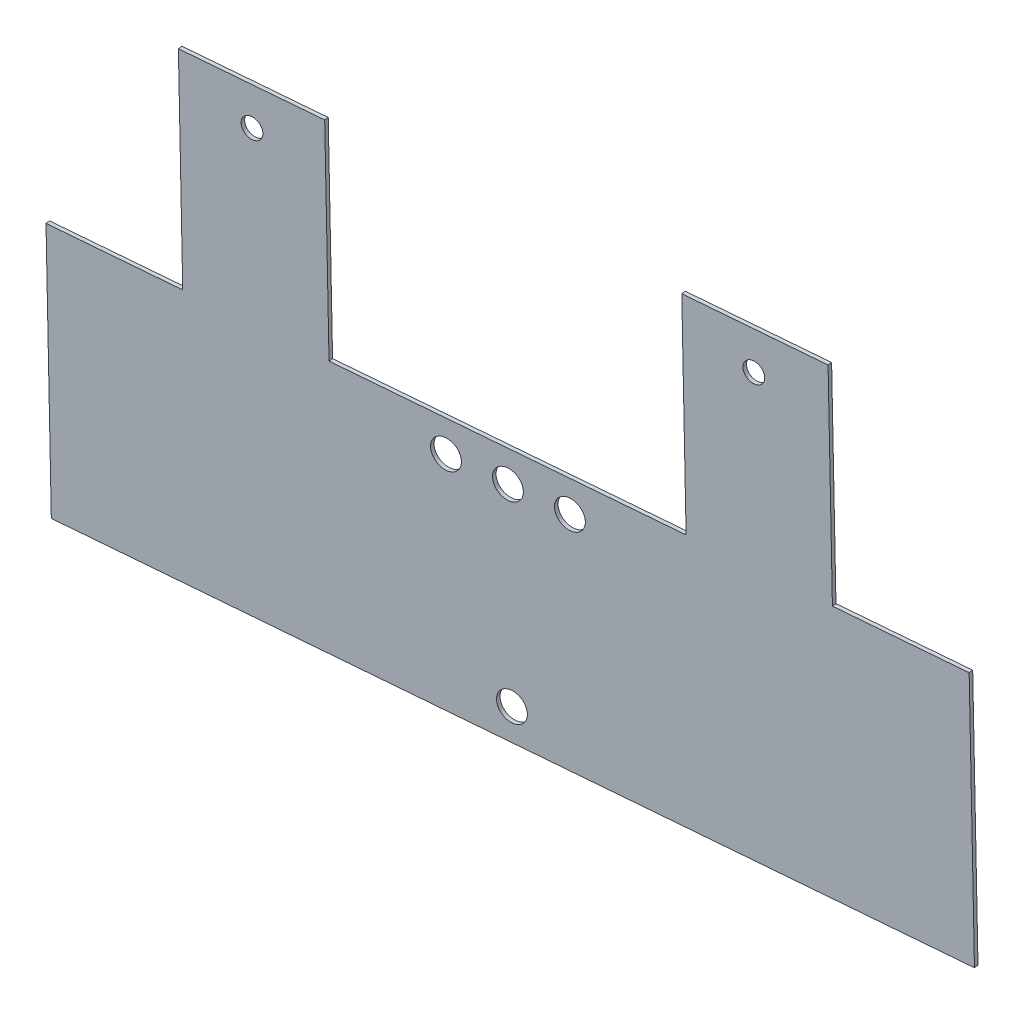
ISO-10303-21;
HEADER;
FILE_DESCRIPTION(('STEP AP214'),'2;1');
FILE_NAME('part.step','',(''),(''),'','','');
FILE_SCHEMA(('AUTOMOTIVE_DESIGN { 1 0 10303 214 1 1 1 1 }'));
ENDSEC;
DATA;
#1=APPLICATION_CONTEXT('core data for automotive mechanical design processes');
#2=APPLICATION_PROTOCOL_DEFINITION('international standard','automotive_design',2000,#1);
#3=PRODUCT_CONTEXT('',#1,'mechanical');
#4=PRODUCT('Part','Part','',(#3));
#5=PRODUCT_RELATED_PRODUCT_CATEGORY('part','',(#4));
#6=PRODUCT_DEFINITION_FORMATION('','',#4);
#7=PRODUCT_DEFINITION_CONTEXT('part definition',#1,'design');
#8=PRODUCT_DEFINITION('design','',#6,#7);
#9=PRODUCT_DEFINITION_SHAPE('','',#8);
#10=(LENGTH_UNIT() NAMED_UNIT(*) SI_UNIT(.MILLI.,.METRE.));
#11=(NAMED_UNIT(*) PLANE_ANGLE_UNIT() SI_UNIT($,.RADIAN.));
#12=(NAMED_UNIT(*) SI_UNIT($,.STERADIAN.) SOLID_ANGLE_UNIT());
#13=UNCERTAINTY_MEASURE_WITH_UNIT(LENGTH_MEASURE(1.E-05),#10,'distance_accuracy_value','');
#14=(GEOMETRIC_REPRESENTATION_CONTEXT(3) GLOBAL_UNCERTAINTY_ASSIGNED_CONTEXT((#13)) GLOBAL_UNIT_ASSIGNED_CONTEXT((#10,
#11,#12)) REPRESENTATION_CONTEXT('',''));
#15=CARTESIAN_POINT('',(0.,0.,0.));
#16=DIRECTION('',(0.,0.,1.));
#17=DIRECTION('',(1.,0.,0.));
#18=AXIS2_PLACEMENT_3D('',#15,#16,#17);
#19=CARTESIAN_POINT('',(-501.489956429642,-328.947406139133,240.499575413323));
#20=DIRECTION('',(0.99656940991837,0.00195950965151666,-0.0827379691367708));
#21=DIRECTION('',(-0.0827381279808112,0.,-0.996571323176736));
#22=AXIS2_PLACEMENT_3D('',#19,#20,#21);
#23=PLANE('',#22);
#24=DIRECTION('',(-0.00028055772663787,0.999793911631424,0.0202991515117986));
#25=VECTOR('',#24,1.);
#26=CARTESIAN_POINT('',(-501.439505510465,-328.959723900019,241.106959260261));
#27=LINE('',#26,#25);
#28=CARTESIAN_POINT('',(-501.439505510465,-328.959723900019,241.106959260261));
#29=VERTEX_POINT('',#28);
#30=CARTESIAN_POINT('',(-501.450907376476,-288.328099331318,241.9319167777));
#31=VERTEX_POINT('',#30);
#32=EDGE_CURVE('E177',#29,#31,#27,.T.);
#33=ORIENTED_EDGE('',*,*,#32,.T.);
#34=DIRECTION('',(0.082760694186997,-0.0202063006674291,0.99636457831008));
#35=VECTOR('',#34,1.);
#36=CARTESIAN_POINT('',(-501.501358295652,-288.315781570432,241.324532930762));
#37=LINE('',#36,#35);
#38=CARTESIAN_POINT('',(-501.501358295652,-288.315781570432,241.324532930762));
#39=VERTEX_POINT('',#38);
#40=EDGE_CURVE('E12',#39,#31,#37,.T.);
#41=ORIENTED_EDGE('',*,*,#40,.F.);
#42=DIRECTION('',(-0.00028055772663787,0.999793911631424,0.0202991515117986));
#43=VECTOR('',#42,1.);
#44=CARTESIAN_POINT('',(-501.489956429642,-328.947406139133,240.499575413323));
#45=LINE('',#44,#43);
#46=CARTESIAN_POINT('',(-501.489956429642,-328.947406139133,240.499575413323));
#47=VERTEX_POINT('',#46);
#48=EDGE_CURVE('E202',#47,#39,#45,.T.);
#49=ORIENTED_EDGE('',*,*,#48,.F.);
#50=DIRECTION('',(0.082760694186997,-0.0202063006674291,0.99636457831008));
#51=VECTOR('',#50,1.);
#52=CARTESIAN_POINT('',(-501.489956429642,-328.947406139133,240.499575413323));
#53=LINE('',#52,#51);
#54=EDGE_CURVE('E173',#47,#29,#53,.T.);
#55=ORIENTED_EDGE('',*,*,#54,.T.);
#56=EDGE_LOOP('',(#33,#41,#49,#55));
#57=FACE_BOUND('',#56,.T.);
#58=ADVANCED_FACE('F56',(#57),#23,.F.);
#59=CARTESIAN_POINT('',(-501.501358295652,-288.315781570432,241.324532930762));
#60=DIRECTION('',(0.000280557726639362,-0.999793911631424,-0.0202991515117987));
#61=DIRECTION('',(0.,0.0202991523106987,-0.999793950979634));
#62=AXIS2_PLACEMENT_3D('',#59,#60,#61);
#63=PLANE('',#62);
#64=DIRECTION('',(0.99656940991837,0.00195950965151815,-0.0827379691367705));
#65=VECTOR('',#64,1.);
#66=CARTESIAN_POINT('',(-501.450907376476,-288.328099331318,241.9319167777));
#67=LINE('',#66,#65);
#68=CARTESIAN_POINT('',(-481.580309912113,-288.289028668377,240.282204411082));
#69=VERTEX_POINT('',#68);
#70=EDGE_CURVE('E181',#31,#69,#67,.T.);
#71=ORIENTED_EDGE('',*,*,#70,.T.);
#72=DIRECTION('',(0.082760694186997,-0.0202063006674291,0.99636457831008));
#73=VECTOR('',#72,1.);
#74=CARTESIAN_POINT('',(-481.63076083129,-288.27671090749,239.674820564144));
#75=LINE('',#74,#73);
#76=CARTESIAN_POINT('',(-481.63076083129,-288.27671090749,239.674820564144));
#77=VERTEX_POINT('',#76);
#78=EDGE_CURVE('E64',#77,#69,#75,.T.);
#79=ORIENTED_EDGE('',*,*,#78,.F.);
#80=DIRECTION('',(0.99656940991837,0.00195950965151815,-0.0827379691367705));
#81=VECTOR('',#80,1.);
#82=CARTESIAN_POINT('',(-501.501358295652,-288.315781570432,241.324532930762));
#83=LINE('',#82,#81);
#84=EDGE_CURVE('E125',#39,#77,#83,.T.);
#85=ORIENTED_EDGE('',*,*,#84,.F.);
#86=ORIENTED_EDGE('',*,*,#40,.T.);
#87=EDGE_LOOP('',(#71,#79,#85,#86));
#88=FACE_BOUND('',#87,.T.);
#89=ADVANCED_FACE('F340',(#88),#63,.F.);
#90=CARTESIAN_POINT('',(-481.63076083129,-288.27671090749,239.674820564144));
#91=DIRECTION('',(0.99656940991837,0.00195950965151761,-0.0827379691367708));
#92=DIRECTION('',(-0.0827381279808112,0.,-0.996571323176736));
#93=AXIS2_PLACEMENT_3D('',#90,#91,#92);
#94=PLANE('',#93);
#95=DIRECTION('',(-0.000280557726638828,0.999793911631424,0.0202991515117985));
#96=VECTOR('',#95,1.);
#97=CARTESIAN_POINT('',(-481.580309912113,-288.289028668377,240.282204411082));
#98=LINE('',#97,#96);
#99=CARTESIAN_POINT('',(-481.589628158372,-255.082579541952,240.956406098194));
#100=VERTEX_POINT('',#99);
#101=EDGE_CURVE('E184',#69,#100,#98,.T.);
#102=ORIENTED_EDGE('',*,*,#101,.T.);
#103=DIRECTION('',(0.082760694186997,-0.0202063006674291,0.99636457831008));
#104=VECTOR('',#103,1.);
#105=CARTESIAN_POINT('',(-481.640079077549,-255.070261781065,240.349022251256));
#106=LINE('',#105,#104);
#107=CARTESIAN_POINT('',(-481.640079077549,-255.070261781065,240.349022251256));
#108=VERTEX_POINT('',#107);
#109=EDGE_CURVE('E221',#108,#100,#106,.T.);
#110=ORIENTED_EDGE('',*,*,#109,.F.);
#111=DIRECTION('',(-0.000280557726638828,0.999793911631424,0.0202991515117985));
#112=VECTOR('',#111,1.);
#113=CARTESIAN_POINT('',(-481.63076083129,-288.27671090749,239.674820564144));
#114=LINE('',#113,#112);
#115=EDGE_CURVE('E229',#77,#108,#114,.T.);
#116=ORIENTED_EDGE('',*,*,#115,.F.);
#117=ORIENTED_EDGE('',*,*,#78,.T.);
#118=EDGE_LOOP('',(#102,#110,#116,#117));
#119=FACE_BOUND('',#118,.T.);
#120=ADVANCED_FACE('F227',(#119),#94,.F.);
#121=CARTESIAN_POINT('',(-481.640079077549,-255.070261781065,240.349022251256));
#122=DIRECTION('',(0.000280557726637702,-0.999793911631424,-0.0202991515117986));
#123=DIRECTION('',(0.,0.0202991523106985,-0.999793950979634));
#124=AXIS2_PLACEMENT_3D('',#121,#122,#123);
#125=PLANE('',#124);
#126=DIRECTION('',(0.99656940991837,0.00195950965151649,-0.0827379691367709));
#127=VECTOR('',#126,1.);
#128=CARTESIAN_POINT('',(-481.589628158372,-255.082579541952,240.956406098194));
#129=LINE('',#128,#127);
#130=CARTESIAN_POINT('',(-460.326823228354,-255.040771444027,239.191108788692));
#131=VERTEX_POINT('',#130);
#132=EDGE_CURVE('E186',#100,#131,#129,.T.);
#133=ORIENTED_EDGE('',*,*,#132,.T.);
#134=DIRECTION('',(0.082760694186997,-0.0202063006674291,0.99636457831008));
#135=VECTOR('',#134,1.);
#136=CARTESIAN_POINT('',(-460.37727414753,-255.028453683141,238.583724941754));
#137=LINE('',#136,#135);
#138=CARTESIAN_POINT('',(-460.37727414753,-255.028453683141,238.583724941754));
#139=VERTEX_POINT('',#138);
#140=EDGE_CURVE('E218',#139,#131,#137,.T.);
#141=ORIENTED_EDGE('',*,*,#140,.F.);
#142=DIRECTION('',(0.99656940991837,0.00195950965151649,-0.0827379691367709));
#143=VECTOR('',#142,1.);
#144=CARTESIAN_POINT('',(-481.640079077549,-255.070261781065,240.349022251256));
#145=LINE('',#144,#143);
#146=EDGE_CURVE('E245',#108,#139,#145,.T.);
#147=ORIENTED_EDGE('',*,*,#146,.F.);
#148=ORIENTED_EDGE('',*,*,#109,.T.);
#149=EDGE_LOOP('',(#133,#141,#147,#148));
#150=FACE_BOUND('',#149,.T.);
#151=ADVANCED_FACE('F236',(#150),#125,.F.);
#152=CARTESIAN_POINT('',(-460.367955901271,-288.234902809565,237.909523254642));
#153=DIRECTION('',(-0.99656940991837,-0.00195950965151761,0.0827379691367708));
#154=DIRECTION('',(0.0827381279808112,0.,0.996571323176736));
#155=AXIS2_PLACEMENT_3D('',#152,#153,#154);
#156=PLANE('',#155);
#157=DIRECTION('',(0.000280557726638828,-0.999793911631424,-0.0202991515117985));
#158=VECTOR('',#157,1.);
#159=CARTESIAN_POINT('',(-460.317504982095,-288.247220570452,238.51690710158));
#160=LINE('',#159,#158);
#161=CARTESIAN_POINT('',(-460.317504982095,-288.247220570452,238.51690710158));
#162=VERTEX_POINT('',#161);
#163=EDGE_CURVE('E188',#131,#162,#160,.T.);
#164=ORIENTED_EDGE('',*,*,#163,.T.);
#165=DIRECTION('',(0.082760694186997,-0.0202063006674291,0.99636457831008));
#166=VECTOR('',#165,1.);
#167=CARTESIAN_POINT('',(-460.367955901271,-288.234902809565,237.909523254642));
#168=LINE('',#167,#166);
#169=CARTESIAN_POINT('',(-460.367955901271,-288.234902809565,237.909523254642));
#170=VERTEX_POINT('',#169);
#171=EDGE_CURVE('E215',#170,#162,#168,.T.);
#172=ORIENTED_EDGE('',*,*,#171,.F.);
#173=DIRECTION('',(0.000280557726638828,-0.999793911631424,-0.0202991515117985));
#174=VECTOR('',#173,1.);
#175=CARTESIAN_POINT('',(-460.367955901271,-288.234902809565,237.909523254642));
#176=LINE('',#175,#174);
#177=EDGE_CURVE('E242',#139,#170,#176,.T.);
#178=ORIENTED_EDGE('',*,*,#177,.F.);
#179=ORIENTED_EDGE('',*,*,#140,.T.);
#180=EDGE_LOOP('',(#164,#172,#178,#179));
#181=FACE_BOUND('',#180,.T.);
#182=ADVANCED_FACE('F240',(#181),#156,.F.);
#183=CARTESIAN_POINT('',(-460.367955901271,-288.234902809565,237.909523254642));
#184=DIRECTION('',(0.000280557726638659,-0.999793911631424,-0.0202991515117987));
#185=DIRECTION('',(0.,0.0202991523106986,-0.999793950979634));
#186=AXIS2_PLACEMENT_3D('',#183,#184,#185);
#187=PLANE('',#186);
#188=DIRECTION('',(0.99656940991837,0.00195950965151746,-0.0827379691367711));
#189=VECTOR('',#188,1.);
#190=CARTESIAN_POINT('',(-460.317504982095,-288.247220570452,238.51690710158));
#191=LINE('',#190,#189);
#192=CARTESIAN_POINT('',(-408.426135807645,-288.145188902897,234.208741048628));
#193=VERTEX_POINT('',#192);
#194=EDGE_CURVE('E190',#162,#193,#191,.T.);
#195=ORIENTED_EDGE('',*,*,#194,.T.);
#196=DIRECTION('',(0.082760694186997,-0.0202063006674291,0.99636457831008));
#197=VECTOR('',#196,1.);
#198=CARTESIAN_POINT('',(-408.476586726822,-288.132871142011,233.60135720169));
#199=LINE('',#198,#197);
#200=CARTESIAN_POINT('',(-408.476586726822,-288.132871142011,233.60135720169));
#201=VERTEX_POINT('',#200);
#202=EDGE_CURVE('E212',#201,#193,#199,.T.);
#203=ORIENTED_EDGE('',*,*,#202,.F.);
#204=DIRECTION('',(0.99656940991837,0.00195950965151746,-0.0827379691367711));
#205=VECTOR('',#204,1.);
#206=CARTESIAN_POINT('',(-460.367955901271,-288.234902809565,237.909523254642));
#207=LINE('',#206,#205);
#208=EDGE_CURVE('E244',#170,#201,#207,.T.);
#209=ORIENTED_EDGE('',*,*,#208,.F.);
#210=ORIENTED_EDGE('',*,*,#171,.T.);
#211=EDGE_LOOP('',(#195,#203,#209,#210));
#212=FACE_BOUND('',#211,.T.);
#213=ADVANCED_FACE('F353',(#212),#187,.F.);
#214=CARTESIAN_POINT('',(-408.476586726822,-288.132871142011,233.60135720169));
#215=DIRECTION('',(0.99656940991837,0.00195950965151767,-0.0827379691367708));
#216=DIRECTION('',(-0.0827381279808112,0.,-0.996571323176736));
#217=AXIS2_PLACEMENT_3D('',#214,#215,#216);
#218=PLANE('',#217);
#219=DIRECTION('',(-0.000280557726638828,0.999793911631424,0.0202991515117993));
#220=VECTOR('',#219,1.);
#221=CARTESIAN_POINT('',(-408.426135807645,-288.145188902897,234.208741048628));
#222=LINE('',#221,#220);
#223=CARTESIAN_POINT('',(-408.435454053904,-254.938739776473,234.88294273574));
#224=VERTEX_POINT('',#223);
#225=EDGE_CURVE('E192',#193,#224,#222,.T.);
#226=ORIENTED_EDGE('',*,*,#225,.T.);
#227=DIRECTION('',(0.082760694186997,-0.0202063006674291,0.99636457831008));
#228=VECTOR('',#227,1.);
#229=CARTESIAN_POINT('',(-408.485904973081,-254.926422015586,234.275558888802));
#230=LINE('',#229,#228);
#231=CARTESIAN_POINT('',(-408.485904973081,-254.926422015586,234.275558888802));
#232=VERTEX_POINT('',#231);
#233=EDGE_CURVE('E209',#232,#224,#230,.T.);
#234=ORIENTED_EDGE('',*,*,#233,.F.);
#235=DIRECTION('',(-0.000280557726638828,0.999793911631424,0.0202991515117993));
#236=VECTOR('',#235,1.);
#237=CARTESIAN_POINT('',(-408.476586726822,-288.132871142011,233.60135720169));
#238=LINE('',#237,#236);
#239=EDGE_CURVE('E247',#201,#232,#238,.T.);
#240=ORIENTED_EDGE('',*,*,#239,.F.);
#241=ORIENTED_EDGE('',*,*,#202,.T.);
#242=EDGE_LOOP('',(#226,#234,#240,#241));
#243=FACE_BOUND('',#242,.T.);
#244=ADVANCED_FACE('F356',(#243),#218,.F.);
#245=CARTESIAN_POINT('',(-408.485904973081,-254.926422015586,234.275558888802));
#246=DIRECTION('',(0.000280557726637702,-0.999793911631424,-0.0202991515117986));
#247=DIRECTION('',(0.,0.0202991523106985,-0.999793950979634));
#248=AXIS2_PLACEMENT_3D('',#245,#246,#247);
#249=PLANE('',#248);
#250=DIRECTION('',(0.99656940991837,0.00195950965151649,-0.0827379691367709));
#251=VECTOR('',#250,1.);
#252=CARTESIAN_POINT('',(-408.435454053904,-254.938739776473,234.88294273574));
#253=LINE('',#252,#251);
#254=CARTESIAN_POINT('',(-387.172649123886,-254.896931678548,233.117645426238));
#255=VERTEX_POINT('',#254);
#256=EDGE_CURVE('E194',#224,#255,#253,.T.);
#257=ORIENTED_EDGE('',*,*,#256,.T.);
#258=DIRECTION('',(0.082760694186997,-0.0202063006674291,0.99636457831008));
#259=VECTOR('',#258,1.);
#260=CARTESIAN_POINT('',(-387.223100043062,-254.884613917661,232.5102615793));
#261=LINE('',#260,#259);
#262=CARTESIAN_POINT('',(-387.223100043062,-254.884613917661,232.5102615793));
#263=VERTEX_POINT('',#262);
#264=EDGE_CURVE('E206',#263,#255,#261,.T.);
#265=ORIENTED_EDGE('',*,*,#264,.F.);
#266=DIRECTION('',(0.99656940991837,0.00195950965151649,-0.0827379691367709));
#267=VECTOR('',#266,1.);
#268=CARTESIAN_POINT('',(-408.485904973081,-254.926422015586,234.275558888802));
#269=LINE('',#268,#267);
#270=EDGE_CURVE('E253',#232,#263,#269,.T.);
#271=ORIENTED_EDGE('',*,*,#270,.F.);
#272=ORIENTED_EDGE('',*,*,#233,.T.);
#273=EDGE_LOOP('',(#257,#265,#271,#272));
#274=FACE_BOUND('',#273,.T.);
#275=ADVANCED_FACE('F259',(#274),#249,.F.);
#276=CARTESIAN_POINT('',(-387.213781796803,-288.091063044086,231.836059892188));
#277=DIRECTION('',(-0.99656940991837,-0.00195950965151761,0.0827379691367708));
#278=DIRECTION('',(0.0827381279808112,0.,0.996571323176736));
#279=AXIS2_PLACEMENT_3D('',#276,#277,#278);
#280=PLANE('',#279);
#281=DIRECTION('',(0.000280557726638828,-0.999793911631424,-0.0202991515117985));
#282=VECTOR('',#281,1.);
#283=CARTESIAN_POINT('',(-387.163330877627,-288.103380804973,232.443443739126));
#284=LINE('',#283,#282);
#285=CARTESIAN_POINT('',(-387.163330877627,-288.103380804973,232.443443739126));
#286=VERTEX_POINT('',#285);
#287=EDGE_CURVE('E196',#255,#286,#284,.T.);
#288=ORIENTED_EDGE('',*,*,#287,.T.);
#289=DIRECTION('',(0.082760694186997,-0.0202063006674291,0.99636457831008));
#290=VECTOR('',#289,1.);
#291=CARTESIAN_POINT('',(-387.213781796803,-288.091063044086,231.836059892188));
#292=LINE('',#291,#290);
#293=CARTESIAN_POINT('',(-387.213781796803,-288.091063044086,231.836059892188));
#294=VERTEX_POINT('',#293);
#295=EDGE_CURVE('E168',#294,#286,#292,.T.);
#296=ORIENTED_EDGE('',*,*,#295,.F.);
#297=DIRECTION('',(0.000280557726638828,-0.999793911631424,-0.0202991515117985));
#298=VECTOR('',#297,1.);
#299=CARTESIAN_POINT('',(-387.213781796803,-288.091063044086,231.836059892188));
#300=LINE('',#299,#298);
#301=EDGE_CURVE('E157',#263,#294,#300,.T.);
#302=ORIENTED_EDGE('',*,*,#301,.F.);
#303=ORIENTED_EDGE('',*,*,#264,.T.);
#304=EDGE_LOOP('',(#288,#296,#302,#303));
#305=FACE_BOUND('',#304,.T.);
#306=ADVANCED_FACE('F263',(#305),#280,.F.);
#307=CARTESIAN_POINT('',(-387.213781796803,-288.091063044086,231.836059892188));
#308=DIRECTION('',(0.000280557726639362,-0.999793911631424,-0.0202991515117987));
#309=DIRECTION('',(0.,0.0202991523106987,-0.999793950979634));
#310=AXIS2_PLACEMENT_3D('',#307,#308,#309);
#311=PLANE('',#310);
#312=DIRECTION('',(0.99656940991837,0.00195950965151815,-0.0827379691367705));
#313=VECTOR('',#312,1.);
#314=CARTESIAN_POINT('',(-387.163330877627,-288.103380804973,232.443443739126));
#315=LINE('',#314,#313);
#316=CARTESIAN_POINT('',(-367.292733413265,-288.064310142031,230.793731372508));
#317=VERTEX_POINT('',#316);
#318=EDGE_CURVE('E166',#286,#317,#315,.T.);
#319=ORIENTED_EDGE('',*,*,#318,.T.);
#320=DIRECTION('',(0.082760694186997,-0.0202063006674291,0.99636457831008));
#321=VECTOR('',#320,1.);
#322=CARTESIAN_POINT('',(-367.343184332441,-288.051992381144,230.18634752557));
#323=LINE('',#322,#321);
#324=CARTESIAN_POINT('',(-367.343184332441,-288.051992381144,230.18634752557));
#325=VERTEX_POINT('',#324);
#326=EDGE_CURVE('E163',#325,#317,#323,.T.);
#327=ORIENTED_EDGE('',*,*,#326,.F.);
#328=DIRECTION('',(0.99656940991837,0.00195950965151815,-0.0827379691367705));
#329=VECTOR('',#328,1.);
#330=CARTESIAN_POINT('',(-387.213781796803,-288.091063044086,231.836059892188));
#331=LINE('',#330,#329);
#332=EDGE_CURVE('E150',#294,#325,#331,.T.);
#333=ORIENTED_EDGE('',*,*,#332,.F.);
#334=ORIENTED_EDGE('',*,*,#295,.T.);
#335=EDGE_LOOP('',(#319,#327,#333,#334));
#336=FACE_BOUND('',#335,.T.);
#337=ADVANCED_FACE('F164',(#336),#311,.F.);
#338=CARTESIAN_POINT('',(-367.331782466431,-328.683616949845,229.361390008131));
#339=DIRECTION('',(-0.99656940991837,-0.00195950965151394,0.0827379691367708));
#340=DIRECTION('',(0.0827381279808113,0.,0.996571323176736));
#341=AXIS2_PLACEMENT_3D('',#338,#339,#340);
#342=PLANE('',#341);
#343=DIRECTION('',(0.000280557726635138,-0.999793911631424,-0.0202991515117986));
#344=VECTOR('',#343,1.);
#345=CARTESIAN_POINT('',(-367.281331547254,-328.695934710732,229.968773855068));
#346=LINE('',#345,#344);
#347=CARTESIAN_POINT('',(-367.281331547254,-328.695934710732,229.968773855068));
#348=VERTEX_POINT('',#347);
#349=EDGE_CURVE('E199',#317,#348,#346,.T.);
#350=ORIENTED_EDGE('',*,*,#349,.T.);
#351=DIRECTION('',(0.082760694186997,-0.0202063006674291,0.99636457831008));
#352=VECTOR('',#351,1.);
#353=CARTESIAN_POINT('',(-367.331782466431,-328.683616949845,229.361390008131));
#354=LINE('',#353,#352);
#355=CARTESIAN_POINT('',(-367.331782466431,-328.683616949845,229.361390008131));
#356=VERTEX_POINT('',#355);
#357=EDGE_CURVE('E169',#356,#348,#354,.T.);
#358=ORIENTED_EDGE('',*,*,#357,.F.);
#359=DIRECTION('',(0.000280557726635138,-0.999793911631424,-0.0202991515117986));
#360=VECTOR('',#359,1.);
#361=CARTESIAN_POINT('',(-367.331782466431,-328.683616949845,229.361390008131));
#362=LINE('',#361,#360);
#363=EDGE_CURVE('E154',#325,#356,#362,.T.);
#364=ORIENTED_EDGE('',*,*,#363,.F.);
#365=ORIENTED_EDGE('',*,*,#326,.T.);
#366=EDGE_LOOP('',(#350,#358,#364,#365));
#367=FACE_BOUND('',#366,.T.);
#368=ADVANCED_FACE('F171',(#367),#342,.F.);
#369=CARTESIAN_POINT('',(-501.489956429642,-328.947406139133,240.499575413323));
#370=DIRECTION('',(-0.000280557726639362,0.999793911631424,0.0202991515117987));
#371=DIRECTION('',(0.,-0.0202991523106987,0.999793950979634));
#372=AXIS2_PLACEMENT_3D('',#369,#370,#371);
#373=PLANE('',#372);
#374=DIRECTION('',(-0.99656940991837,-0.00195950965151815,0.0827379691367705));
#375=VECTOR('',#374,1.);
#376=CARTESIAN_POINT('',(-501.439505510465,-328.959723900019,241.106959260261));
#377=LINE('',#376,#375);
#378=EDGE_CURVE('E113',#348,#29,#377,.T.);
#379=ORIENTED_EDGE('',*,*,#378,.T.);
#380=ORIENTED_EDGE('',*,*,#54,.F.);
#381=DIRECTION('',(-0.99656940991837,-0.00195950965151794,0.0827379691367709));
#382=VECTOR('',#381,1.);
#383=CARTESIAN_POINT('',(-386.587283527019,-328.721478176367,230.960035357474));
#384=LINE('',#383,#382);
#385=EDGE_CURVE('E72',#356,#47,#384,.T.);
#386=ORIENTED_EDGE('',*,*,#385,.F.);
#387=ORIENTED_EDGE('',*,*,#357,.T.);
#388=EDGE_LOOP('',(#379,#380,#386,#387));
#389=FACE_BOUND('',#388,.T.);
#390=ADVANCED_FACE('F264',(#389),#373,.F.);
#391=CARTESIAN_POINT('',(16.9467758676456,-4.13761208613666,204.023991786853));
#392=DIRECTION('',(-0.0827606941869968,0.0202063006674291,-0.99636457831008));
#393=DIRECTION('',(-0.996568045750024,0.,0.0827775947341869));
#394=AXIS2_PLACEMENT_3D('',#391,#392,#393);
#395=PLANE('',#394);
#396=CARTESIAN_POINT('',(-425.456033015418,-293.165229384197,234.909658847919));
#397=DIRECTION('',(-0.0827606941869968,0.0202063006674291,-0.99636457831008));
#398=DIRECTION('',(-0.996568045750024,0.,0.0827775947341869));
#399=AXIS2_PLACEMENT_3D('',#396,#397,#398);
#400=CIRCLE('',#399,2.24999999999995);
#401=CARTESIAN_POINT('',(-427.698311118356,-293.165229384197,235.095908436071));
#402=VERTEX_POINT('',#401);
#403=EDGE_CURVE('E294',#402,#402,#400,.T.);
#404=ORIENTED_EDGE('',*,*,#403,.F.);
#405=EDGE_LOOP('',(#404));
#406=FACE_BOUND('',#405,.T.);
#407=CARTESIAN_POINT('',(-443.473097110311,-293.200655527759,236.405485709734));
#408=DIRECTION('',(-0.0827606941869968,0.0202063006674291,-0.99636457831008));
#409=DIRECTION('',(-0.996568045750024,0.,0.0827775947341869));
#410=AXIS2_PLACEMENT_3D('',#407,#408,#409);
#411=CIRCLE('',#410,2.24999999999995);
#412=CARTESIAN_POINT('',(-445.715375213249,-293.200655527759,236.591735297886));
#413=VERTEX_POINT('',#412);
#414=EDGE_CURVE('E297',#413,#413,#411,.T.);
#415=ORIENTED_EDGE('',*,*,#414,.F.);
#416=EDGE_LOOP('',(#415));
#417=FACE_BOUND('',#416,.T.);
#418=CARTESIAN_POINT('',(-471.054813760999,-261.10108861582,239.347476604441));
#419=DIRECTION('',(-0.0827606941869969,0.0202063006674291,-0.99636457831008));
#420=DIRECTION('',(-0.996568045750024,0.,0.0827775947341869));
#421=AXIS2_PLACEMENT_3D('',#418,#419,#420);
#422=CIRCLE('',#421,1.58750000000002);
#423=CARTESIAN_POINT('',(-472.636865533627,-261.10108861582,239.478886036081));
#424=VERTEX_POINT('',#423);
#425=EDGE_CURVE('E291',#424,#424,#422,.T.);
#426=ORIENTED_EDGE('',*,*,#425,.F.);
#427=EDGE_LOOP('',(#426));
#428=FACE_BOUND('',#427,.T.);
#429=CARTESIAN_POINT('',(-398.13117772993,-260.957702145591,233.293153155214));
#430=DIRECTION('',(-0.0827606941869968,0.0202063006674291,-0.99636457831008));
#431=DIRECTION('',(-0.996568045750024,0.,0.0827775947341869));
#432=AXIS2_PLACEMENT_3D('',#429,#430,#431);
#433=CIRCLE('',#432,1.58750000000003);
#434=CARTESIAN_POINT('',(-399.713229502559,-260.957702145591,233.424562586854));
#435=VERTEX_POINT('',#434);
#436=EDGE_CURVE('E285',#435,#435,#433,.T.);
#437=ORIENTED_EDGE('',*,*,#436,.F.);
#438=EDGE_LOOP('',(#437));
#439=FACE_BOUND('',#438,.T.);
#440=CARTESIAN_POINT('',(-434.464565062866,-293.182942453393,235.657572278879));
#441=DIRECTION('',(0.0827606941869969,-0.0202063006674292,0.99636457831008));
#442=DIRECTION('',(-0.996566946014347,-0.00391901177606996,0.0826980257221201));
#443=AXIS2_PLACEMENT_3D('',#440,#441,#442);
#444=CIRCLE('',#443,2.24999999999995);
#445=CARTESIAN_POINT('',(-436.706840691398,-293.191760229889,235.843642836754));
#446=VERTEX_POINT('',#445);
#447=EDGE_CURVE('E279',#446,#446,#444,.T.);
#448=ORIENTED_EDGE('',*,*,#447,.T.);
#449=EDGE_LOOP('',(#448));
#450=FACE_BOUND('',#449,.T.);
#451=CARTESIAN_POINT('',(-434.455968774122,-323.816627903961,235.035606276595));
#452=DIRECTION('',(-0.0827606941869969,0.0202063006674291,-0.99636457831008));
#453=DIRECTION('',(-0.996568045750024,0.,0.0827775947341869));
#454=AXIS2_PLACEMENT_3D('',#451,#452,#453);
#455=CIRCLE('',#454,2.24999999999995);
#456=CARTESIAN_POINT('',(-436.69824687706,-323.816627903961,235.221855864746));
#457=VERTEX_POINT('',#456);
#458=EDGE_CURVE('E273',#457,#457,#455,.T.);
#459=ORIENTED_EDGE('',*,*,#458,.F.);
#460=EDGE_LOOP('',(#459));
#461=FACE_BOUND('',#460,.T.);
#462=ORIENTED_EDGE('',*,*,#48,.T.);
#463=ORIENTED_EDGE('',*,*,#84,.T.);
#464=ORIENTED_EDGE('',*,*,#115,.T.);
#465=ORIENTED_EDGE('',*,*,#146,.T.);
#466=ORIENTED_EDGE('',*,*,#177,.T.);
#467=ORIENTED_EDGE('',*,*,#208,.T.);
#468=ORIENTED_EDGE('',*,*,#239,.T.);
#469=ORIENTED_EDGE('',*,*,#270,.T.);
#470=ORIENTED_EDGE('',*,*,#301,.T.);
#471=ORIENTED_EDGE('',*,*,#332,.T.);
#472=ORIENTED_EDGE('',*,*,#363,.T.);
#473=ORIENTED_EDGE('',*,*,#385,.T.);
#474=EDGE_LOOP('',(#462,#463,#464,#465,#466,#467,#468,#469,#470,#471,#472,#473));
#475=FACE_BOUND('',#474,.T.);
#476=ADVANCED_FACE('F152',(#406,#417,#428,#439,#450,#461,#475),#395,.T.);
#477=CARTESIAN_POINT('',(16.997226786822,-4.14992984702352,204.631375633791));
#478=DIRECTION('',(-0.0827606941869968,0.0202063006674291,-0.99636457831008));
#479=DIRECTION('',(-0.996568045750024,0.,0.0827775947341869));
#480=AXIS2_PLACEMENT_3D('',#477,#478,#479);
#481=PLANE('',#480);
#482=CARTESIAN_POINT('',(-425.405582096242,-293.177547145084,235.517042694857));
#483=DIRECTION('',(0.0827606941869968,-0.0202063006674291,0.99636457831008));
#484=DIRECTION('',(0.996568045750024,0.,-0.0827775947341869));
#485=AXIS2_PLACEMENT_3D('',#482,#483,#484);
#486=CIRCLE('',#485,2.24999999999995);
#487=CARTESIAN_POINT('',(-423.163303993304,-293.177547145084,235.330793106705));
#488=VERTEX_POINT('',#487);
#489=EDGE_CURVE('E300',#488,#488,#486,.T.);
#490=ORIENTED_EDGE('',*,*,#489,.F.);
#491=EDGE_LOOP('',(#490));
#492=FACE_BOUND('',#491,.T.);
#493=CARTESIAN_POINT('',(-443.422646191135,-293.212973288646,237.012869556672));
#494=DIRECTION('',(0.0827606941869968,-0.0202063006674291,0.99636457831008));
#495=DIRECTION('',(0.996568045750024,0.,-0.0827775947341869));
#496=AXIS2_PLACEMENT_3D('',#493,#494,#495);
#497=CIRCLE('',#496,2.24999999999995);
#498=CARTESIAN_POINT('',(-441.180368088198,-293.212973288646,236.82661996852));
#499=VERTEX_POINT('',#498);
#500=EDGE_CURVE('E301',#499,#499,#497,.T.);
#501=ORIENTED_EDGE('',*,*,#500,.F.);
#502=EDGE_LOOP('',(#501));
#503=FACE_BOUND('',#502,.T.);
#504=CARTESIAN_POINT('',(-471.004362841823,-261.113406376707,239.954860451379));
#505=DIRECTION('',(-0.0827606941869968,0.0202063006674291,-0.99636457831008));
#506=DIRECTION('',(-0.996568045750024,0.,0.0827775947341869));
#507=AXIS2_PLACEMENT_3D('',#504,#505,#506);
#508=CIRCLE('',#507,1.58750000000002);
#509=CARTESIAN_POINT('',(-472.586414614451,-261.113406376707,240.086269883019));
#510=VERTEX_POINT('',#509);
#511=EDGE_CURVE('E288',#510,#510,#508,.F.);
#512=ORIENTED_EDGE('',*,*,#511,.F.);
#513=EDGE_LOOP('',(#512));
#514=FACE_BOUND('',#513,.T.);
#515=CARTESIAN_POINT('',(-398.080726810754,-260.970019906477,233.900537002151));
#516=DIRECTION('',(-0.0827606941869968,0.0202063006674291,-0.99636457831008));
#517=DIRECTION('',(-0.996568045750024,0.,0.0827775947341869));
#518=AXIS2_PLACEMENT_3D('',#515,#516,#517);
#519=CIRCLE('',#518,1.58750000000003);
#520=CARTESIAN_POINT('',(-399.662778583382,-260.970019906477,234.031946433792));
#521=VERTEX_POINT('',#520);
#522=EDGE_CURVE('E282',#521,#521,#519,.F.);
#523=ORIENTED_EDGE('',*,*,#522,.F.);
#524=EDGE_LOOP('',(#523));
#525=FACE_BOUND('',#524,.T.);
#526=CARTESIAN_POINT('',(-434.414114143689,-293.19526021428,236.264956125817));
#527=DIRECTION('',(-0.0827606941869968,0.0202063006674291,-0.99636457831008));
#528=DIRECTION('',(-0.996568045750024,0.,0.0827775947341869));
#529=AXIS2_PLACEMENT_3D('',#526,#527,#528);
#530=CIRCLE('',#529,2.24999999999995);
#531=CARTESIAN_POINT('',(-436.656392246627,-293.19526021428,236.451205713969));
#532=VERTEX_POINT('',#531);
#533=EDGE_CURVE('E276',#532,#532,#530,.T.);
#534=ORIENTED_EDGE('',*,*,#533,.T.);
#535=EDGE_LOOP('',(#534));
#536=FACE_BOUND('',#535,.T.);
#537=CARTESIAN_POINT('',(-434.405517854946,-323.828945664848,235.642990123532));
#538=DIRECTION('',(-0.0827606941869968,0.0202063006674291,-0.99636457831008));
#539=DIRECTION('',(-0.996568045750024,0.,0.0827775947341869));
#540=AXIS2_PLACEMENT_3D('',#537,#538,#539);
#541=CIRCLE('',#540,2.24999999999995);
#542=CARTESIAN_POINT('',(-436.647795957883,-323.828945664848,235.829239711684));
#543=VERTEX_POINT('',#542);
#544=EDGE_CURVE('E182',#543,#543,#541,.F.);
#545=ORIENTED_EDGE('',*,*,#544,.F.);
#546=EDGE_LOOP('',(#545));
#547=FACE_BOUND('',#546,.T.);
#548=ORIENTED_EDGE('',*,*,#32,.F.);
#549=ORIENTED_EDGE('',*,*,#378,.F.);
#550=ORIENTED_EDGE('',*,*,#349,.F.);
#551=ORIENTED_EDGE('',*,*,#318,.F.);
#552=ORIENTED_EDGE('',*,*,#287,.F.);
#553=ORIENTED_EDGE('',*,*,#256,.F.);
#554=ORIENTED_EDGE('',*,*,#225,.F.);
#555=ORIENTED_EDGE('',*,*,#194,.F.);
#556=ORIENTED_EDGE('',*,*,#163,.F.);
#557=ORIENTED_EDGE('',*,*,#132,.F.);
#558=ORIENTED_EDGE('',*,*,#101,.F.);
#559=ORIENTED_EDGE('',*,*,#70,.F.);
#560=EDGE_LOOP('',(#548,#549,#550,#551,#552,#553,#554,#555,#556,#557,#558,#559));
#561=FACE_BOUND('',#560,.T.);
#562=ADVANCED_FACE('F231',(#492,#503,#514,#525,#536,#547,#561),#481,.F.);
#563=CARTESIAN_POINT('',(-433.878832022268,-323.95753777487,241.983815472246));
#564=DIRECTION('',(-0.0827606941869969,0.0202063006674291,-0.99636457831008));
#565=DIRECTION('',(-0.996568045750024,0.,0.0827775947341869));
#566=AXIS2_PLACEMENT_3D('',#563,#564,#565);
#567=CYLINDRICAL_SURFACE('',#566,2.24999999999995);
#568=ORIENTED_EDGE('',*,*,#544,.T.);
#569=EDGE_LOOP('',(#568));
#570=FACE_BOUND('',#569,.T.);
#571=ORIENTED_EDGE('',*,*,#458,.T.);
#572=EDGE_LOOP('',(#571));
#573=FACE_BOUND('',#572,.T.);
#574=ADVANCED_FACE('F311',(#570,#573),#567,.F.);
#575=CARTESIAN_POINT('',(-433.887428311011,-293.323852324301,242.605781474531));
#576=DIRECTION('',(-0.0827606941869969,0.0202063006674292,-0.99636457831008));
#577=DIRECTION('',(-0.996568045750024,0.,0.0827775947341869));
#578=AXIS2_PLACEMENT_3D('',#575,#576,#577);
#579=CYLINDRICAL_SURFACE('',#578,2.24999999999995);
#580=ORIENTED_EDGE('',*,*,#533,.F.);
#581=EDGE_LOOP('',(#580));
#582=FACE_BOUND('',#581,.T.);
#583=ORIENTED_EDGE('',*,*,#447,.F.);
#584=EDGE_LOOP('',(#583));
#585=FACE_BOUND('',#584,.T.);
#586=ADVANCED_FACE('F325',(#582,#585),#579,.F.);
#587=CARTESIAN_POINT('',(-397.709120695476,-261.060748784104,238.374341553744));
#588=DIRECTION('',(-0.0827606941869968,0.0202063006674291,-0.99636457831008));
#589=DIRECTION('',(-0.996568045750024,0.,0.0827775947341869));
#590=AXIS2_PLACEMENT_3D('',#587,#588,#589);
#591=CYLINDRICAL_SURFACE('',#590,1.58750000000003);
#592=ORIENTED_EDGE('',*,*,#522,.T.);
#593=EDGE_LOOP('',(#592));
#594=FACE_BOUND('',#593,.T.);
#595=ORIENTED_EDGE('',*,*,#436,.T.);
#596=EDGE_LOOP('',(#595));
#597=FACE_BOUND('',#596,.T.);
#598=ADVANCED_FACE('F391',(#594,#597),#591,.F.);
#599=CARTESIAN_POINT('',(-470.632756726544,-261.204135254333,244.428665002971));
#600=DIRECTION('',(-0.0827606941869969,0.0202063006674291,-0.99636457831008));
#601=DIRECTION('',(-0.996568045750024,0.,0.0827775947341869));
#602=AXIS2_PLACEMENT_3D('',#599,#600,#601);
#603=CYLINDRICAL_SURFACE('',#602,1.58750000000002);
#604=ORIENTED_EDGE('',*,*,#511,.T.);
#605=EDGE_LOOP('',(#604));
#606=FACE_BOUND('',#605,.T.);
#607=ORIENTED_EDGE('',*,*,#425,.T.);
#608=EDGE_LOOP('',(#607));
#609=FACE_BOUND('',#608,.T.);
#610=ADVANCED_FACE('F399',(#606,#609),#603,.F.);
#611=CARTESIAN_POINT('',(-443.63285835437,-293.16164928495,234.482103527764));
#612=DIRECTION('',(0.0827606941869968,-0.0202063006674291,0.99636457831008));
#613=DIRECTION('',(0.996568045750024,0.,-0.0827775947341869));
#614=AXIS2_PLACEMENT_3D('',#611,#612,#613);
#615=CYLINDRICAL_SURFACE('',#614,2.24999999999995);
#616=ORIENTED_EDGE('',*,*,#414,.T.);
#617=EDGE_LOOP('',(#616));
#618=FACE_BOUND('',#617,.T.);
#619=ORIENTED_EDGE('',*,*,#500,.T.);
#620=EDGE_LOOP('',(#619));
#621=FACE_BOUND('',#620,.T.);
#622=ADVANCED_FACE('F407',(#618,#621),#615,.F.);
#623=CARTESIAN_POINT('',(-425.615794259477,-293.126223141388,232.986276665949));
#624=DIRECTION('',(0.0827606941869968,-0.0202063006674291,0.99636457831008));
#625=DIRECTION('',(0.996568045750024,0.,-0.0827775947341869));
#626=AXIS2_PLACEMENT_3D('',#623,#624,#625);
#627=CYLINDRICAL_SURFACE('',#626,2.24999999999995);
#628=ORIENTED_EDGE('',*,*,#403,.T.);
#629=EDGE_LOOP('',(#628));
#630=FACE_BOUND('',#629,.T.);
#631=ORIENTED_EDGE('',*,*,#489,.T.);
#632=EDGE_LOOP('',(#631));
#633=FACE_BOUND('',#632,.T.);
#634=ADVANCED_FACE('F307',(#630,#633),#627,.F.);
#635=CLOSED_SHELL('',(#58,#89,#120,#151,#182,#213,#244,#275,#306,#337,#368,#390,#476,#562,#574,
#586,#598,#610,#622,#634));
#636=MANIFOLD_SOLID_BREP('B2',#635);
#637=ADVANCED_BREP_SHAPE_REPRESENTATION('',(#18,#636),#14);
#638=SHAPE_DEFINITION_REPRESENTATION(#9,#637);
ENDSEC;
END-ISO-10303-21;
